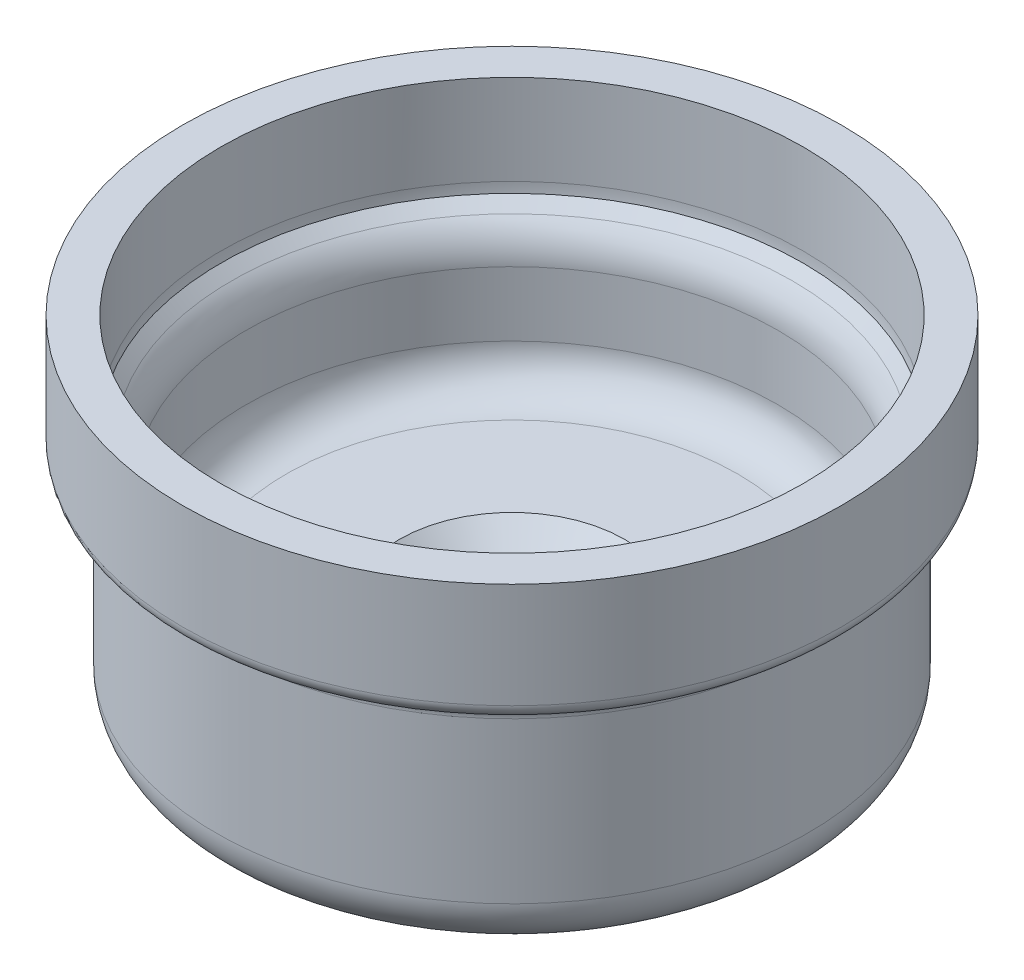
ISO-10303-21;
HEADER;
FILE_DESCRIPTION(('STEP AP214'),'2;1');
FILE_NAME('part.step','',(''),(''),'','','');
FILE_SCHEMA(('AUTOMOTIVE_DESIGN { 1 0 10303 214 1 1 1 1 }'));
ENDSEC;
DATA;
#1=APPLICATION_CONTEXT('core data for automotive mechanical design processes');
#2=APPLICATION_PROTOCOL_DEFINITION('international standard','automotive_design',2000,#1);
#3=PRODUCT_CONTEXT('',#1,'mechanical');
#4=PRODUCT('Part','Part','',(#3));
#5=PRODUCT_RELATED_PRODUCT_CATEGORY('part','',(#4));
#6=PRODUCT_DEFINITION_FORMATION('','',#4);
#7=PRODUCT_DEFINITION_CONTEXT('part definition',#1,'design');
#8=PRODUCT_DEFINITION('design','',#6,#7);
#9=PRODUCT_DEFINITION_SHAPE('','',#8);
#10=(LENGTH_UNIT() NAMED_UNIT(*) SI_UNIT(.MILLI.,.METRE.));
#11=(NAMED_UNIT(*) PLANE_ANGLE_UNIT() SI_UNIT($,.RADIAN.));
#12=(NAMED_UNIT(*) SI_UNIT($,.STERADIAN.) SOLID_ANGLE_UNIT());
#13=UNCERTAINTY_MEASURE_WITH_UNIT(LENGTH_MEASURE(1.E-05),#10,'distance_accuracy_value','');
#14=(GEOMETRIC_REPRESENTATION_CONTEXT(3) GLOBAL_UNCERTAINTY_ASSIGNED_CONTEXT((#13)) GLOBAL_UNIT_ASSIGNED_CONTEXT((#10,
#11,#12)) REPRESENTATION_CONTEXT('',''));
#15=CARTESIAN_POINT('',(0.,0.,0.));
#16=DIRECTION('',(0.,0.,1.));
#17=DIRECTION('',(1.,0.,0.));
#18=AXIS2_PLACEMENT_3D('',#15,#16,#17);
#19=CARTESIAN_POINT('',(0.,-10.,0.));
#20=DIRECTION('',(0.,-1.,0.));
#21=DIRECTION('',(0.,0.,-1.));
#22=AXIS2_PLACEMENT_3D('',#19,#20,#21);
#23=PLANE('',#22);
#24=CARTESIAN_POINT('',(0.,-10.,0.));
#25=DIRECTION('',(0.,-1.,0.));
#26=DIRECTION('',(0.,0.,-1.));
#27=AXIS2_PLACEMENT_3D('',#24,#25,#26);
#28=CIRCLE('',#27,24.2582039324994);
#29=CARTESIAN_POINT('',(0.,-10.,-24.2582039324994));
#30=VERTEX_POINT('',#29);
#31=EDGE_CURVE('E38',#30,#30,#28,.F.);
#32=ORIENTED_EDGE('',*,*,#31,.T.);
#33=EDGE_LOOP('',(#32));
#34=FACE_BOUND('',#33,.T.);
#35=CARTESIAN_POINT('',(0.,-10.,0.));
#36=DIRECTION('',(0.,-1.,0.));
#37=DIRECTION('',(0.,0.,-1.));
#38=AXIS2_PLACEMENT_3D('',#35,#36,#37);
#39=CIRCLE('',#38,24.55);
#40=CARTESIAN_POINT('',(0.,-10.,-24.55));
#41=VERTEX_POINT('',#40);
#42=EDGE_CURVE('E63',#41,#41,#39,.T.);
#43=ORIENTED_EDGE('',*,*,#42,.T.);
#44=EDGE_LOOP('',(#43));
#45=FACE_BOUND('',#44,.T.);
#46=ADVANCED_FACE('F31',(#34,#45),#23,.T.);
#47=CARTESIAN_POINT('',(0.,-10.,0.));
#48=DIRECTION('',(0.,1.,0.));
#49=DIRECTION('',(0.,0.,1.));
#50=AXIS2_PLACEMENT_3D('',#47,#48,#49);
#51=CIRCLE('',#50,4.1);
#52=CARTESIAN_POINT('',(0.,-10.,4.1));
#53=VERTEX_POINT('',#52);
#54=EDGE_CURVE('E93',#53,#53,#51,.T.);
#55=ORIENTED_EDGE('',*,*,#54,.T.);
#56=EDGE_LOOP('',(#55));
#57=FACE_BOUND('',#56,.T.);
#58=CARTESIAN_POINT('',(0.,-10.,0.));
#59=DIRECTION('',(0.,-1.,0.));
#60=DIRECTION('',(0.,0.,-1.));
#61=AXIS2_PLACEMENT_3D('',#58,#59,#60);
#62=CIRCLE('',#61,12.55);
#63=CARTESIAN_POINT('',(0.,-10.,-12.55));
#64=VERTEX_POINT('',#63);
#65=EDGE_CURVE('E97',#64,#64,#62,.T.);
#66=ORIENTED_EDGE('',*,*,#65,.T.);
#67=EDGE_LOOP('',(#66));
#68=FACE_BOUND('',#67,.T.);
#69=ADVANCED_FACE('F103',(#57,#68),#23,.T.);
#70=CARTESIAN_POINT('',(0.,15.,0.));
#71=DIRECTION('',(0.,-1.,0.));
#72=DIRECTION('',(0.,0.,-1.));
#73=AXIS2_PLACEMENT_3D('',#70,#71,#72);
#74=CYLINDRICAL_SURFACE('',#73,26.55);
#75=CARTESIAN_POINT('',(0.,10.4289321881345,0.));
#76=DIRECTION('',(0.,-1.,0.));
#77=DIRECTION('',(0.,0.,-1.));
#78=AXIS2_PLACEMENT_3D('',#75,#76,#77);
#79=CIRCLE('',#78,26.55);
#80=CARTESIAN_POINT('',(0.,10.4289321881345,-26.55));
#81=VERTEX_POINT('',#80);
#82=EDGE_CURVE('E69',#81,#81,#79,.F.);
#83=ORIENTED_EDGE('',*,*,#82,.T.);
#84=EDGE_LOOP('',(#83));
#85=FACE_BOUND('',#84,.T.);
#86=CARTESIAN_POINT('',(0.,4.,0.));
#87=DIRECTION('',(0.,-1.,0.));
#88=DIRECTION('',(0.,0.,-1.));
#89=AXIS2_PLACEMENT_3D('',#86,#87,#88);
#90=CIRCLE('',#89,26.55);
#91=CARTESIAN_POINT('',(0.,4.,-26.55));
#92=VERTEX_POINT('',#91);
#93=EDGE_CURVE('E75',#92,#92,#90,.T.);
#94=ORIENTED_EDGE('',*,*,#93,.T.);
#95=EDGE_LOOP('',(#94));
#96=FACE_BOUND('',#95,.T.);
#97=ADVANCED_FACE('F124',(#85,#96),#74,.F.);
#98=CARTESIAN_POINT('',(0.,0.,0.));
#99=DIRECTION('',(0.,-1.,0.));
#100=DIRECTION('',(0.,0.,-1.));
#101=AXIS2_PLACEMENT_3D('',#98,#99,#100);
#102=PLANE('',#101);
#103=CARTESIAN_POINT('',(0.,0.,0.));
#104=DIRECTION('',(0.,-1.,0.));
#105=DIRECTION('',(0.,0.,-1.));
#106=AXIS2_PLACEMENT_3D('',#103,#104,#105);
#107=CIRCLE('',#106,11.25);
#108=CARTESIAN_POINT('',(0.,0.,-11.25));
#109=VERTEX_POINT('',#108);
#110=EDGE_CURVE('E46',#109,#109,#107,.T.);
#111=ORIENTED_EDGE('',*,*,#110,.T.);
#112=EDGE_LOOP('',(#111));
#113=FACE_BOUND('',#112,.T.);
#114=CARTESIAN_POINT('',(0.,0.,0.));
#115=DIRECTION('',(0.,-1.,0.));
#116=DIRECTION('',(0.,0.,-1.));
#117=AXIS2_PLACEMENT_3D('',#114,#115,#116);
#118=CIRCLE('',#117,22.55);
#119=CARTESIAN_POINT('',(0.,0.,-22.55));
#120=VERTEX_POINT('',#119);
#121=EDGE_CURVE('E78',#120,#120,#118,.F.);
#122=ORIENTED_EDGE('',*,*,#121,.T.);
#123=EDGE_LOOP('',(#122));
#124=FACE_BOUND('',#123,.T.);
#125=ADVANCED_FACE('F131',(#113,#124),#102,.F.);
#126=CARTESIAN_POINT('',(0.,12.5,0.));
#127=DIRECTION('',(0.,1.,0.));
#128=DIRECTION('',(0.,0.,1.));
#129=AXIS2_PLACEMENT_3D('',#126,#127,#128);
#130=CONICAL_SURFACE('',#129,26.55,0.785398163397452);
#131=CARTESIAN_POINT('',(0.,13.9644660940672,0.));
#132=DIRECTION('',(0.,-1.,0.));
#133=DIRECTION('',(0.,0.,-1.));
#134=AXIS2_PLACEMENT_3D('',#131,#132,#133);
#135=CIRCLE('',#134,28.0144660940673);
#136=CARTESIAN_POINT('',(0.,13.9644660940672,28.0144660940673));
#137=VERTEX_POINT('',#136);
#138=EDGE_CURVE('E66',#137,#137,#135,.T.);
#139=CARTESIAN_POINT('',(0.,15.,0.));
#140=DIRECTION('',(0.,1.,0.));
#141=DIRECTION('',(0.,0.,1.));
#142=AXIS2_PLACEMENT_3D('',#139,#140,#141);
#143=CIRCLE('',#142,29.05);
#144=CARTESIAN_POINT('',(0.,15.,29.05));
#145=VERTEX_POINT('',#144);
#146=EDGE_CURVE('E81',#145,#145,#143,.F.);
#147=CARTESIAN_POINT('',(0.,13.9644660940672,28.0144660940673));
#148=CARTESIAN_POINT('',(0.,13.9752529055874,28.0252529055874));
#149=CARTESIAN_POINT('',(0.,13.9860397171075,28.0360397171075));
#150=CARTESIAN_POINT('',(0.,14.0076133401478,28.0576133401478));
#151=CARTESIAN_POINT('',(0.,14.0184001516679,28.0684001516679));
#152=CARTESIAN_POINT('',(0.,14.0399737747082,28.0899737747082));
#153=CARTESIAN_POINT('',(0.,14.0507605862283,28.1007605862283));
#154=CARTESIAN_POINT('',(0.,14.0723342092686,28.1223342092686));
#155=CARTESIAN_POINT('',(0.,14.0831210207887,28.1331210207887));
#156=CARTESIAN_POINT('',(0.,14.104694643829,28.154694643829));
#157=CARTESIAN_POINT('',(0.,14.1154814553491,28.1654814553491));
#158=CARTESIAN_POINT('',(0.,14.1370550783894,28.1870550783894));
#159=CARTESIAN_POINT('',(0.,14.1478418899095,28.1978418899095));
#160=CARTESIAN_POINT('',(0.,14.1694155129498,28.2194155129498));
#161=CARTESIAN_POINT('',(0.,14.1802023244699,28.2302023244699));
#162=CARTESIAN_POINT('',(0.,14.2017759475102,28.2517759475102));
#163=CARTESIAN_POINT('',(0.,14.2125627590303,28.2625627590303));
#164=CARTESIAN_POINT('',(0.,14.2341363820706,28.2841363820706));
#165=CARTESIAN_POINT('',(0.,14.2449231935907,28.2949231935907));
#166=CARTESIAN_POINT('',(0.,14.266496816631,28.316496816631));
#167=CARTESIAN_POINT('',(0.,14.2772836281511,28.3272836281511));
#168=CARTESIAN_POINT('',(0.,14.2988572511914,28.3488572511914));
#169=CARTESIAN_POINT('',(0.,14.3096440627115,28.3596440627115));
#170=CARTESIAN_POINT('',(0.,14.3312176857518,28.3812176857518));
#171=CARTESIAN_POINT('',(0.,14.3420044972719,28.3920044972719));
#172=CARTESIAN_POINT('',(0.,14.3635781203122,28.4135781203122));
#173=CARTESIAN_POINT('',(0.,14.3743649318323,28.4243649318323));
#174=CARTESIAN_POINT('',(0.,14.3959385548726,28.4459385548726));
#175=CARTESIAN_POINT('',(0.,14.4067253663927,28.4567253663927));
#176=CARTESIAN_POINT('',(0.,14.428298989433,28.478298989433));
#177=CARTESIAN_POINT('',(0.,14.4390858009531,28.4890858009531));
#178=CARTESIAN_POINT('',(0.,14.4606594239934,28.5106594239934));
#179=CARTESIAN_POINT('',(0.,14.4714462355135,28.5214462355135));
#180=CARTESIAN_POINT('',(0.,14.4930198585538,28.5430198585538));
#181=CARTESIAN_POINT('',(0.,14.5038066700739,28.5538066700739));
#182=CARTESIAN_POINT('',(0.,14.5253802931142,28.5753802931142));
#183=CARTESIAN_POINT('',(0.,14.5361671046343,28.5861671046343));
#184=CARTESIAN_POINT('',(0.,14.5577407276746,28.6077407276746));
#185=CARTESIAN_POINT('',(0.,14.5685275391947,28.6185275391947));
#186=CARTESIAN_POINT('',(0.,14.5901011622349,28.640101162235));
#187=CARTESIAN_POINT('',(0.,14.6008879737551,28.6508879737551));
#188=CARTESIAN_POINT('',(0.,14.6224615967953,28.6724615967954));
#189=CARTESIAN_POINT('',(0.,14.6332484083155,28.6832484083155));
#190=CARTESIAN_POINT('',(0.,14.6548220313557,28.7048220313558));
#191=CARTESIAN_POINT('',(0.,14.6656088428759,28.7156088428759));
#192=CARTESIAN_POINT('',(0.,14.6871824659161,28.7371824659162));
#193=CARTESIAN_POINT('',(0.,14.6979692774363,28.7479692774363));
#194=CARTESIAN_POINT('',(0.,14.7195429004765,28.7695429004766));
#195=CARTESIAN_POINT('',(0.,14.7303297119967,28.7803297119967));
#196=CARTESIAN_POINT('',(0.,14.7519033350369,28.801903335037));
#197=CARTESIAN_POINT('',(0.,14.7626901465571,28.8126901465571));
#198=CARTESIAN_POINT('',(0.,14.7842637695973,28.8342637695974));
#199=CARTESIAN_POINT('',(0.,14.7950505811175,28.8450505811175));
#200=CARTESIAN_POINT('',(0.,14.8166242041577,28.8666242041578));
#201=CARTESIAN_POINT('',(0.,14.8274110156779,28.8774110156779));
#202=CARTESIAN_POINT('',(0.,14.8489846387181,28.8989846387182));
#203=CARTESIAN_POINT('',(0.,14.8597714502383,28.9097714502383));
#204=CARTESIAN_POINT('',(0.,14.8813450732785,28.9313450732786));
#205=CARTESIAN_POINT('',(0.,14.8921318847987,28.9421318847987));
#206=CARTESIAN_POINT('',(0.,14.9137055078389,28.963705507839));
#207=CARTESIAN_POINT('',(0.,14.9244923193591,28.9744923193591));
#208=CARTESIAN_POINT('',(0.,14.9460659423993,28.9960659423994));
#209=CARTESIAN_POINT('',(0.,14.9568527539195,29.0068527539195));
#210=CARTESIAN_POINT('',(0.,14.9784263769597,29.0284263769598));
#211=CARTESIAN_POINT('',(0.,14.9892131884799,29.0392131884799));
#212=CARTESIAN_POINT('',(0.,15.,29.05));
#213=B_SPLINE_CURVE_WITH_KNOTS('',3,(#147,#148,#149,#150,#151,#152,#153,#154,#155,#156,#157,
#158,#159,#160,#161,#162,#163,#164,#165,#166,#167,#168,#169,#170,#171,#172,#173,#174,#175,#176,
#177,#178,#179,#180,#181,#182,#183,#184,#185,#186,#187,#188,#189,#190,#191,#192,#193,#194,#195,
#196,#197,#198,#199,#200,#201,#202,#203,#204,#205,#206,#207,#208,#209,#210,#211,#212),
.UNSPECIFIED.,.F.,.F.,(4,2,2,2,2,2,2,2,2,2,2,2,2,2,2,2,2,2,2,2,2,2,2,2,2,2,2,2,2,2,2,2,4),(0.,
0.0457645654396013,0.091529130879205,0.137293696318809,0.18305826175841,0.228822827198014,
0.274587392637618,0.320351958077219,0.366116523516823,0.411881088956424,0.457645654396029,
0.503410219835633,0.549174785275234,0.594939350714838,0.640703916154441,0.686468481594043,
0.732233047033647,0.777997612473248,0.823762177912852,0.869526743352455,0.915291308792057,
0.96105587423166,1.00682043967126,1.05258500511087,1.09834957055047,1.14411413599007,
1.18987870142968,1.23564326686928,1.28140783230888,1.32717239774848,1.37293696318809,
1.41870152862769,1.46446609406729),.UNSPECIFIED.);
#214=EDGE_CURVE('BSEAM134',#137,#145,#213,.T.);
#215=ORIENTED_EDGE('',*,*,#138,.T.);
#216=ORIENTED_EDGE('',*,*,#146,.F.);
#217=ORIENTED_EDGE('',*,*,#214,.T.);
#218=ORIENTED_EDGE('',*,*,#214,.F.);
#219=EDGE_LOOP('',(#215,#217,#216,#218));
#220=FACE_BOUND('',#219,.T.);
#221=ADVANCED_FACE('F134',(#220),#130,.F.);
#222=CARTESIAN_POINT('',(0.,4.,0.));
#223=DIRECTION('',(0.,-1.,0.));
#224=DIRECTION('',(0.,0.,-1.));
#225=AXIS2_PLACEMENT_3D('',#222,#223,#224);
#226=TOROIDAL_SURFACE('',#225,22.55,4.);
#227=ORIENTED_EDGE('',*,*,#93,.F.);
#228=EDGE_LOOP('',(#227));
#229=FACE_BOUND('',#228,.T.);
#230=ORIENTED_EDGE('',*,*,#121,.F.);
#231=EDGE_LOOP('',(#230));
#232=FACE_BOUND('',#231,.T.);
#233=ADVANCED_FACE('F147',(#229,#232),#226,.F.);
#234=CARTESIAN_POINT('',(0.,25.,0.));
#235=DIRECTION('',(0.,1.,0.));
#236=DIRECTION('',(0.,0.,1.));
#237=AXIS2_PLACEMENT_3D('',#234,#235,#236);
#238=PLANE('',#237);
#239=CARTESIAN_POINT('',(0.,25.,0.));
#240=DIRECTION('',(0.,1.,0.));
#241=DIRECTION('',(0.,0.,1.));
#242=AXIS2_PLACEMENT_3D('',#239,#240,#241);
#243=CIRCLE('',#242,32.9);
#244=CARTESIAN_POINT('',(0.,25.,32.9));
#245=VERTEX_POINT('',#244);
#246=EDGE_CURVE('E84',#245,#245,#243,.T.);
#247=ORIENTED_EDGE('',*,*,#246,.T.);
#248=EDGE_LOOP('',(#247));
#249=FACE_BOUND('',#248,.T.);
#250=CARTESIAN_POINT('',(0.,25.,0.));
#251=DIRECTION('',(0.,1.,0.));
#252=DIRECTION('',(0.,0.,1.));
#253=AXIS2_PLACEMENT_3D('',#250,#251,#252);
#254=CIRCLE('',#253,29.1);
#255=CARTESIAN_POINT('',(0.,25.,29.1));
#256=VERTEX_POINT('',#255);
#257=EDGE_CURVE('E87',#256,#256,#254,.T.);
#258=ORIENTED_EDGE('',*,*,#257,.F.);
#259=EDGE_LOOP('',(#258));
#260=FACE_BOUND('',#259,.T.);
#261=ADVANCED_FACE('F151',(#249,#260),#238,.T.);
#262=CARTESIAN_POINT('',(0.,25.,0.));
#263=DIRECTION('',(0.,-1.,0.));
#264=DIRECTION('',(0.,0.,-1.));
#265=AXIS2_PLACEMENT_3D('',#262,#263,#264);
#266=CYLINDRICAL_SURFACE('',#265,32.9);
#267=CARTESIAN_POINT('',(0.,14.4967842369812,0.));
#268=DIRECTION('',(0.,1.,0.));
#269=DIRECTION('',(0.,0.,1.));
#270=AXIS2_PLACEMENT_3D('',#267,#268,#269);
#271=CIRCLE('',#270,32.9);
#272=CARTESIAN_POINT('',(0.,14.4967842369812,32.9));
#273=VERTEX_POINT('',#272);
#274=EDGE_CURVE('E54',#273,#273,#271,.T.);
#275=ORIENTED_EDGE('',*,*,#274,.T.);
#276=EDGE_LOOP('',(#275));
#277=FACE_BOUND('',#276,.T.);
#278=ORIENTED_EDGE('',*,*,#246,.F.);
#279=EDGE_LOOP('',(#278));
#280=FACE_BOUND('',#279,.T.);
#281=ADVANCED_FACE('F129',(#277,#280),#266,.T.);
#282=CARTESIAN_POINT('',(0.,25.,0.));
#283=DIRECTION('',(0.,-1.,0.));
#284=DIRECTION('',(0.,0.,-1.));
#285=AXIS2_PLACEMENT_3D('',#282,#283,#284);
#286=CYLINDRICAL_SURFACE('',#285,29.1);
#287=CARTESIAN_POINT('',(0.,15.9987492177716,0.));
#288=DIRECTION('',(0.,-1.,0.));
#289=DIRECTION('',(0.,0.,-1.));
#290=AXIS2_PLACEMENT_3D('',#287,#288,#289);
#291=CIRCLE('',#290,29.1);
#292=CARTESIAN_POINT('',(0.,15.9987492177716,-29.1));
#293=VERTEX_POINT('',#292);
#294=EDGE_CURVE('E10',#293,#293,#291,.T.);
#295=ORIENTED_EDGE('',*,*,#294,.T.);
#296=EDGE_LOOP('',(#295));
#297=FACE_BOUND('',#296,.T.);
#298=ORIENTED_EDGE('',*,*,#257,.T.);
#299=EDGE_LOOP('',(#298));
#300=FACE_BOUND('',#299,.T.);
#301=ADVANCED_FACE('F143',(#297,#300),#286,.F.);
#302=CARTESIAN_POINT('',(0.,15.,0.));
#303=DIRECTION('',(0.,-1.,0.));
#304=DIRECTION('',(0.,0.,-1.));
#305=AXIS2_PLACEMENT_3D('',#302,#303,#304);
#306=CYLINDRICAL_SURFACE('',#305,29.55);
#307=CARTESIAN_POINT('',(0.,-5.,0.));
#308=DIRECTION('',(0.,-1.,0.));
#309=DIRECTION('',(0.,0.,-1.));
#310=AXIS2_PLACEMENT_3D('',#307,#308,#309);
#311=CIRCLE('',#310,29.55);
#312=CARTESIAN_POINT('',(0.,-5.,-29.55));
#313=VERTEX_POINT('',#312);
#314=EDGE_CURVE('E60',#313,#313,#311,.F.);
#315=ORIENTED_EDGE('',*,*,#314,.T.);
#316=EDGE_LOOP('',(#315));
#317=FACE_BOUND('',#316,.T.);
#318=CARTESIAN_POINT('',(0.,11.,0.));
#319=DIRECTION('',(0.,-1.,0.));
#320=DIRECTION('',(0.,0.,-1.));
#321=AXIS2_PLACEMENT_3D('',#318,#319,#320);
#322=CIRCLE('',#321,29.55);
#323=CARTESIAN_POINT('',(0.,11.,-29.55));
#324=VERTEX_POINT('',#323);
#325=EDGE_CURVE('E72',#324,#324,#322,.T.);
#326=ORIENTED_EDGE('',*,*,#325,.T.);
#327=EDGE_LOOP('',(#326));
#328=FACE_BOUND('',#327,.T.);
#329=ADVANCED_FACE('F139',(#317,#328),#306,.T.);
#330=CARTESIAN_POINT('',(0.,11.,0.));
#331=DIRECTION('',(0.,-1.,0.));
#332=DIRECTION('',(0.,0.,-1.));
#333=AXIS2_PLACEMENT_3D('',#330,#331,#332);
#334=TOROIDAL_SURFACE('',#333,31.55,2.);
#335=CARTESIAN_POINT('',(0.,12.9981624210949,0.));
#336=DIRECTION('',(0.,-1.,0.));
#337=DIRECTION('',(0.,0.,-1.));
#338=AXIS2_PLACEMENT_3D('',#335,#336,#337);
#339=CIRCLE('',#338,31.4642857142873);
#340=CARTESIAN_POINT('',(0.,12.9981624210949,-31.4642857142873));
#341=VERTEX_POINT('',#340);
#342=EDGE_CURVE('E57',#341,#341,#339,.T.);
#343=ORIENTED_EDGE('',*,*,#342,.T.);
#344=EDGE_LOOP('',(#343));
#345=FACE_BOUND('',#344,.T.);
#346=ORIENTED_EDGE('',*,*,#325,.F.);
#347=EDGE_LOOP('',(#346));
#348=FACE_BOUND('',#347,.T.);
#349=ADVANCED_FACE('F142',(#345,#348),#334,.F.);
#350=CARTESIAN_POINT('',(0.,10.4289321881345,0.));
#351=DIRECTION('',(0.,-1.,0.));
#352=DIRECTION('',(0.,0.,-1.));
#353=AXIS2_PLACEMENT_3D('',#350,#351,#352);
#354=TOROIDAL_SURFACE('',#353,31.55,5.);
#355=ORIENTED_EDGE('',*,*,#138,.F.);
#356=EDGE_LOOP('',(#355));
#357=FACE_BOUND('',#356,.T.);
#358=ORIENTED_EDGE('',*,*,#82,.F.);
#359=EDGE_LOOP('',(#358));
#360=FACE_BOUND('',#359,.T.);
#361=ADVANCED_FACE('F155',(#357,#360),#354,.T.);
#362=CARTESIAN_POINT('',(0.,-5.,0.));
#363=DIRECTION('',(0.,-1.,0.));
#364=DIRECTION('',(0.,0.,-1.));
#365=AXIS2_PLACEMENT_3D('',#362,#363,#364);
#366=TOROIDAL_SURFACE('',#365,24.55,5.);
#367=ORIENTED_EDGE('',*,*,#314,.F.);
#368=EDGE_LOOP('',(#367));
#369=FACE_BOUND('',#368,.T.);
#370=ORIENTED_EDGE('',*,*,#42,.F.);
#371=EDGE_LOOP('',(#370));
#372=FACE_BOUND('',#371,.T.);
#373=ADVANCED_FACE('F159',(#369,#372),#366,.T.);
#374=CARTESIAN_POINT('',(0.,14.4967842369812,0.));
#375=DIRECTION('',(0.,1.,0.));
#376=DIRECTION('',(0.,0.,1.));
#377=AXIS2_PLACEMENT_3D('',#374,#375,#376);
#378=TOROIDAL_SURFACE('',#377,31.4,1.5);
#379=ORIENTED_EDGE('',*,*,#274,.F.);
#380=EDGE_LOOP('',(#379));
#381=FACE_BOUND('',#380,.T.);
#382=ORIENTED_EDGE('',*,*,#342,.F.);
#383=EDGE_LOOP('',(#382));
#384=FACE_BOUND('',#383,.T.);
#385=ADVANCED_FACE('F163',(#381,#384),#378,.T.);
#386=CARTESIAN_POINT('',(0.,-7.,0.));
#387=DIRECTION('',(0.,1.,0.));
#388=DIRECTION('',(0.,0.,1.));
#389=AXIS2_PLACEMENT_3D('',#386,#387,#388);
#390=CYLINDRICAL_SURFACE('',#389,8.25);
#391=CARTESIAN_POINT('',(0.,-3.00000000000001,0.));
#392=DIRECTION('',(0.,-1.,0.));
#393=DIRECTION('',(0.,0.,-1.));
#394=AXIS2_PLACEMENT_3D('',#391,#392,#393);
#395=CIRCLE('',#394,8.25);
#396=CARTESIAN_POINT('',(0.,-3.00000000000001,-8.25));
#397=VERTEX_POINT('',#396);
#398=EDGE_CURVE('E51',#397,#397,#395,.F.);
#399=ORIENTED_EDGE('',*,*,#398,.T.);
#400=EDGE_LOOP('',(#399));
#401=FACE_BOUND('',#400,.T.);
#402=CARTESIAN_POINT('',(0.,-7.,0.));
#403=DIRECTION('',(0.,1.,0.));
#404=DIRECTION('',(0.,0.,1.));
#405=AXIS2_PLACEMENT_3D('',#402,#403,#404);
#406=CIRCLE('',#405,8.25);
#407=CARTESIAN_POINT('',(0.,-7.,8.25));
#408=VERTEX_POINT('',#407);
#409=EDGE_CURVE('E90',#408,#408,#406,.T.);
#410=ORIENTED_EDGE('',*,*,#409,.F.);
#411=EDGE_LOOP('',(#410));
#412=FACE_BOUND('',#411,.T.);
#413=ADVANCED_FACE('F167',(#401,#412),#390,.F.);
#414=CARTESIAN_POINT('',(0.,-7.,0.));
#415=DIRECTION('',(0.,1.,0.));
#416=DIRECTION('',(0.,0.,1.));
#417=AXIS2_PLACEMENT_3D('',#414,#415,#416);
#418=PLANE('',#417);
#419=CARTESIAN_POINT('',(0.,-7.,0.));
#420=DIRECTION('',(0.,1.,0.));
#421=DIRECTION('',(0.,0.,1.));
#422=AXIS2_PLACEMENT_3D('',#419,#420,#421);
#423=CIRCLE('',#422,4.1);
#424=CARTESIAN_POINT('',(0.,-7.,4.1));
#425=VERTEX_POINT('',#424);
#426=EDGE_CURVE('E94',#425,#425,#423,.T.);
#427=ORIENTED_EDGE('',*,*,#426,.F.);
#428=EDGE_LOOP('',(#427));
#429=FACE_BOUND('',#428,.T.);
#430=ORIENTED_EDGE('',*,*,#409,.T.);
#431=EDGE_LOOP('',(#430));
#432=FACE_BOUND('',#431,.T.);
#433=ADVANCED_FACE('F170',(#429,#432),#418,.T.);
#434=CARTESIAN_POINT('',(0.,-3.00000000000001,0.));
#435=DIRECTION('',(0.,1.,0.));
#436=DIRECTION('',(0.,0.,1.));
#437=AXIS2_PLACEMENT_3D('',#434,#435,#436);
#438=CONICAL_SURFACE('',#437,8.25,0.785398163397451);
#439=ORIENTED_EDGE('',*,*,#110,.F.);
#440=EDGE_LOOP('',(#439));
#441=FACE_BOUND('',#440,.T.);
#442=ORIENTED_EDGE('',*,*,#398,.F.);
#443=EDGE_LOOP('',(#442));
#444=FACE_BOUND('',#443,.T.);
#445=ADVANCED_FACE('F116',(#441,#444),#438,.F.);
#446=CARTESIAN_POINT('',(0.,-10.,0.));
#447=DIRECTION('',(0.,1.,0.));
#448=DIRECTION('',(0.,0.,1.));
#449=AXIS2_PLACEMENT_3D('',#446,#447,#448);
#450=CYLINDRICAL_SURFACE('',#449,4.1);
#451=ORIENTED_EDGE('',*,*,#54,.F.);
#452=EDGE_LOOP('',(#451));
#453=FACE_BOUND('',#452,.T.);
#454=ORIENTED_EDGE('',*,*,#426,.T.);
#455=EDGE_LOOP('',(#454));
#456=FACE_BOUND('',#455,.T.);
#457=ADVANCED_FACE('F108',(#453,#456),#450,.F.);
#458=CARTESIAN_POINT('',(0.,-10.,0.));
#459=DIRECTION('',(0.,-1.,0.));
#460=DIRECTION('',(0.,0.,-1.));
#461=AXIS2_PLACEMENT_3D('',#458,#459,#460);
#462=TOROIDAL_SURFACE('',#461,17.55,5.);
#463=CARTESIAN_POINT('',(0.,-8.57142857142857,0.));
#464=DIRECTION('',(0.,-1.,0.));
#465=DIRECTION('',(0.,0.,-1.));
#466=AXIS2_PLACEMENT_3D('',#463,#464,#465);
#467=CIRCLE('',#466,22.3415742374996);
#468=CARTESIAN_POINT('',(0.,-8.57142857142857,-22.3415742374996));
#469=VERTEX_POINT('',#468);
#470=EDGE_CURVE('E42',#469,#469,#467,.T.);
#471=ORIENTED_EDGE('',*,*,#470,.T.);
#472=EDGE_LOOP('',(#471));
#473=FACE_BOUND('',#472,.T.);
#474=ORIENTED_EDGE('',*,*,#65,.F.);
#475=EDGE_LOOP('',(#474));
#476=FACE_BOUND('',#475,.T.);
#477=ADVANCED_FACE('F105',(#473,#476),#462,.F.);
#478=CARTESIAN_POINT('',(0.,-8.,0.));
#479=DIRECTION('',(0.,-1.,0.));
#480=DIRECTION('',(0.,0.,-1.));
#481=AXIS2_PLACEMENT_3D('',#478,#479,#480);
#482=TOROIDAL_SURFACE('',#481,24.2582039324994,2.);
#483=ORIENTED_EDGE('',*,*,#31,.F.);
#484=EDGE_LOOP('',(#483));
#485=FACE_BOUND('',#484,.T.);
#486=ORIENTED_EDGE('',*,*,#470,.F.);
#487=EDGE_LOOP('',(#486));
#488=FACE_BOUND('',#487,.T.);
#489=ADVANCED_FACE('F107',(#485,#488),#482,.T.);
#490=CARTESIAN_POINT('',(0.,15.9987492177716,0.));
#491=DIRECTION('',(0.,-1.,0.));
#492=DIRECTION('',(0.,0.,-1.));
#493=AXIS2_PLACEMENT_3D('',#490,#491,#492);
#494=TOROIDAL_SURFACE('',#493,19.1,10.);
#495=ORIENTED_EDGE('',*,*,#294,.F.);
#496=EDGE_LOOP('',(#495));
#497=FACE_BOUND('',#496,.T.);
#498=ORIENTED_EDGE('',*,*,#146,.T.);
#499=EDGE_LOOP('',(#498));
#500=FACE_BOUND('',#499,.T.);
#501=ADVANCED_FACE('F33',(#497,#500),#494,.F.);
#502=CLOSED_SHELL('',(#46,#69,#97,#125,#221,#233,#261,#281,#301,#329,#349,#361,#373,#385,#413,
#433,#445,#457,#477,#489,#501));
#503=MANIFOLD_SOLID_BREP('B2',#502);
#504=ADVANCED_BREP_SHAPE_REPRESENTATION('',(#18,#503),#14);
#505=SHAPE_DEFINITION_REPRESENTATION(#9,#504);
ENDSEC;
END-ISO-10303-21;
